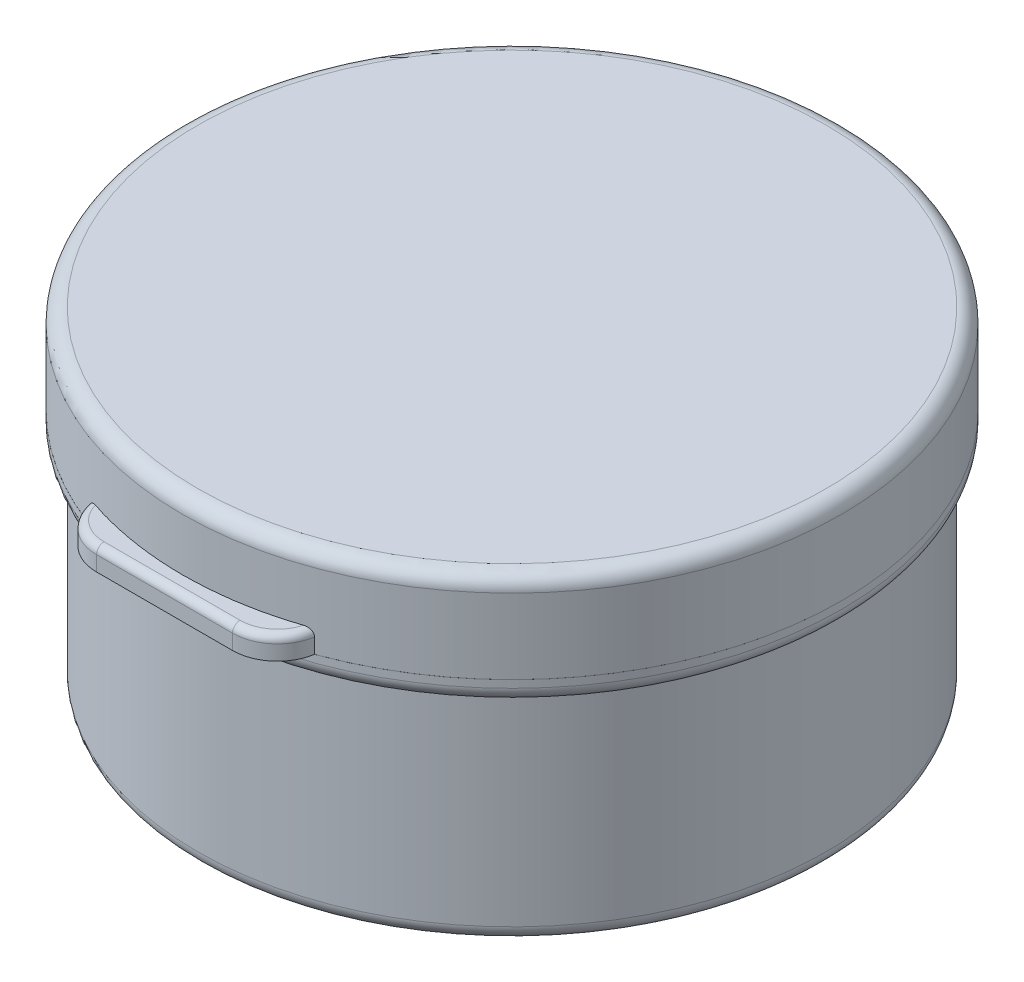
ISO-10303-21;
HEADER;
FILE_DESCRIPTION(('STEP AP214'),'2;1');
FILE_NAME('part.step','',(''),(''),'','','');
FILE_SCHEMA(('AUTOMOTIVE_DESIGN { 1 0 10303 214 1 1 1 1 }'));
ENDSEC;
DATA;
#1=APPLICATION_CONTEXT('core data for automotive mechanical design processes');
#2=APPLICATION_PROTOCOL_DEFINITION('international standard','automotive_design',2000,#1);
#3=PRODUCT_CONTEXT('',#1,'mechanical');
#4=PRODUCT('Part','Part','',(#3));
#5=PRODUCT_RELATED_PRODUCT_CATEGORY('part','',(#4));
#6=PRODUCT_DEFINITION_FORMATION('','',#4);
#7=PRODUCT_DEFINITION_CONTEXT('part definition',#1,'design');
#8=PRODUCT_DEFINITION('design','',#6,#7);
#9=PRODUCT_DEFINITION_SHAPE('','',#8);
#10=(LENGTH_UNIT() NAMED_UNIT(*) SI_UNIT(.MILLI.,.METRE.));
#11=(NAMED_UNIT(*) PLANE_ANGLE_UNIT() SI_UNIT($,.RADIAN.));
#12=(NAMED_UNIT(*) SI_UNIT($,.STERADIAN.) SOLID_ANGLE_UNIT());
#13=UNCERTAINTY_MEASURE_WITH_UNIT(LENGTH_MEASURE(1.E-05),#10,'distance_accuracy_value','');
#14=(GEOMETRIC_REPRESENTATION_CONTEXT(3) GLOBAL_UNCERTAINTY_ASSIGNED_CONTEXT((#13)) GLOBAL_UNIT_ASSIGNED_CONTEXT((#10,
#11,#12)) REPRESENTATION_CONTEXT('',''));
#15=CARTESIAN_POINT('',(0.,0.,0.));
#16=DIRECTION('',(0.,0.,1.));
#17=DIRECTION('',(1.,0.,0.));
#18=AXIS2_PLACEMENT_3D('',#15,#16,#17);
#19=CARTESIAN_POINT('',(0.,21.,0.));
#20=DIRECTION('',(0.,-1.,0.));
#21=DIRECTION('',(0.,0.,-1.));
#22=AXIS2_PLACEMENT_3D('',#19,#20,#21);
#23=CYLINDRICAL_SURFACE('',#22,21.);
#24=CARTESIAN_POINT('',(0.,16.,0.));
#25=DIRECTION('',(0.,1.,0.));
#26=DIRECTION('',(0.,0.,1.));
#27=AXIS2_PLACEMENT_3D('',#24,#25,#26);
#28=CIRCLE('',#27,21.);
#29=CARTESIAN_POINT('',(0.,16.,21.));
#30=VERTEX_POINT('',#29);
#31=EDGE_CURVE('P0_E97',#30,#30,#28,.T.);
#32=ORIENTED_EDGE('',*,*,#31,.T.);
#33=EDGE_LOOP('',(#32));
#34=FACE_BOUND('',#33,.T.);
#35=CARTESIAN_POINT('',(0.,19.5,0.));
#36=DIRECTION('',(0.,1.,0.));
#37=DIRECTION('',(0.,0.,1.));
#38=AXIS2_PLACEMENT_3D('',#35,#36,#37);
#39=CIRCLE('',#38,21.);
#40=CARTESIAN_POINT('',(0.,19.5,21.));
#41=VERTEX_POINT('',#40);
#42=EDGE_CURVE('P0_E341',#41,#41,#39,.T.);
#43=ORIENTED_EDGE('',*,*,#42,.F.);
#44=EDGE_LOOP('',(#43));
#45=FACE_BOUND('',#44,.T.);
#46=ADVANCED_FACE('P0_F19',(#34,#45),#23,.T.);
#47=CARTESIAN_POINT('',(-6.,15.,-21.1660104885167));
#48=DIRECTION('',(-1.,0.,0.));
#49=DIRECTION('',(0.,0.,1.));
#50=AXIS2_PLACEMENT_3D('',#47,#48,#49);
#51=PLANE('',#50);
#52=DIRECTION('',(0.,0.,1.));
#53=VECTOR('',#52,1.);
#54=CARTESIAN_POINT('',(-6.,16.,-21.1660104885167));
#55=LINE('',#54,#53);
#56=CARTESIAN_POINT('',(-6.,16.,-23.));
#57=VERTEX_POINT('',#56);
#58=CARTESIAN_POINT('',(-6.,16.,-21.1660104885167));
#59=VERTEX_POINT('',#58);
#60=EDGE_CURVE('P0_E73',#57,#59,#55,.T.);
#61=ORIENTED_EDGE('',*,*,#60,.F.);
#62=DIRECTION('',(0.,-0.662620048215738,0.748955720789002));
#63=VECTOR('',#62,1.);
#64=CARTESIAN_POINT('',(-6.,14.6507750558159,-21.4749786196495));
#65=LINE('',#64,#63);
#66=CARTESIAN_POINT('',(-6.00000000000001,15.,-21.8697056136383));
#67=VERTEX_POINT('',#66);
#68=EDGE_CURVE('P0_E68',#57,#67,#65,.T.);
#69=ORIENTED_EDGE('',*,*,#68,.T.);
#70=DIRECTION('',(0.,0.,1.));
#71=VECTOR('',#70,1.);
#72=CARTESIAN_POINT('',(-6.,15.,-21.1660104885167));
#73=LINE('',#72,#71);
#74=CARTESIAN_POINT('',(-6.,15.,-21.0267226870701));
#75=VERTEX_POINT('',#74);
#76=EDGE_CURVE('P0_E34',#67,#75,#73,.T.);
#77=ORIENTED_EDGE('',*,*,#76,.T.);
#78=CARTESIAN_POINT('',(-6.,15.,-21.0267226870701));
#79=CARTESIAN_POINT('',(-6.,15.0236927175322,-21.040946709731));
#80=CARTESIAN_POINT('',(-6.,15.047967628017,-21.0541717958448));
#81=CARTESIAN_POINT('',(-6.,15.0975528392953,-21.0785365194592));
#82=CARTESIAN_POINT('',(-6.,15.1228635070889,-21.0896754098236));
#83=CARTESIAN_POINT('',(-6.,15.1989252841215,-21.1193473642655));
#84=CARTESIAN_POINT('',(-6.,15.2509281051254,-21.134807205526));
#85=CARTESIAN_POINT('',(-6.,15.335833680094,-21.1524728369288));
#86=CARTESIAN_POINT('',(-6.,15.3681851254462,-21.1575009958536));
#87=CARTESIAN_POINT('',(-6.,15.4336804313749,-21.1642937668788));
#88=CARTESIAN_POINT('',(-6.,15.4668290656496,-21.1660123634298));
#89=CARTESIAN_POINT('',(-6.,15.5,-21.1660104885167));
#90=B_SPLINE_CURVE_WITH_KNOTS('',3,(#78,#79,#80,#81,#82,#83,#84,#85,#86,#87,#88,#89),
.UNSPECIFIED.,.F.,.F.,(4,2,2,2,2,4),(0.,0.0828485838203804,0.16572678198496,0.327608443244328,
0.425678960276971,0.525103456925898),.UNSPECIFIED.);
#91=CARTESIAN_POINT('',(-6.,15.5,-21.1660104885167));
#92=VERTEX_POINT('',#91);
#93=EDGE_CURVE('P0_E365',#75,#92,#90,.T.);
#94=ORIENTED_EDGE('',*,*,#93,.T.);
#95=DIRECTION('',(0.,1.,0.));
#96=VECTOR('',#95,1.);
#97=CARTESIAN_POINT('',(-6.,15.,-21.1660104885167));
#98=LINE('',#97,#96);
#99=EDGE_CURVE('P0_E95',#92,#59,#98,.T.);
#100=ORIENTED_EDGE('',*,*,#99,.T.);
#101=EDGE_LOOP('',(#61,#69,#77,#94,#100));
#102=FACE_BOUND('',#101,.T.);
#103=ADVANCED_FACE('P0_F144',(#102),#51,.T.);
#104=CARTESIAN_POINT('',(6.,15.,-21.1660104885167));
#105=DIRECTION('',(1.,0.,0.));
#106=DIRECTION('',(0.,0.,-1.));
#107=AXIS2_PLACEMENT_3D('',#104,#105,#106);
#108=PLANE('',#107);
#109=DIRECTION('',(0.,0.,-1.));
#110=VECTOR('',#109,1.);
#111=CARTESIAN_POINT('',(6.,15.,-21.1660104885167));
#112=LINE('',#111,#110);
#113=CARTESIAN_POINT('',(6.,15.,-21.0267226870701));
#114=VERTEX_POINT('',#113);
#115=CARTESIAN_POINT('',(6.,15.,-21.8697056136383));
#116=VERTEX_POINT('',#115);
#117=EDGE_CURVE('P0_E82',#114,#116,#112,.T.);
#118=ORIENTED_EDGE('',*,*,#117,.T.);
#119=DIRECTION('',(0.,0.662620048215738,-0.748955720789002));
#120=VECTOR('',#119,1.);
#121=CARTESIAN_POINT('',(6.,14.6507750558159,-21.4749786196495));
#122=LINE('',#121,#120);
#123=CARTESIAN_POINT('',(6.,16.,-23.));
#124=VERTEX_POINT('',#123);
#125=EDGE_CURVE('P0_E66',#116,#124,#122,.T.);
#126=ORIENTED_EDGE('',*,*,#125,.T.);
#127=DIRECTION('',(0.,0.,-1.));
#128=VECTOR('',#127,1.);
#129=CARTESIAN_POINT('',(6.,16.,-21.1660104885167));
#130=LINE('',#129,#128);
#131=CARTESIAN_POINT('',(6.,16.,-21.1660104885167));
#132=VERTEX_POINT('',#131);
#133=EDGE_CURVE('P0_E74',#132,#124,#130,.T.);
#134=ORIENTED_EDGE('',*,*,#133,.F.);
#135=DIRECTION('',(0.,1.,0.));
#136=VECTOR('',#135,1.);
#137=CARTESIAN_POINT('',(6.,15.,-21.1660104885167));
#138=LINE('',#137,#136);
#139=CARTESIAN_POINT('',(6.,15.5,-21.1660104885167));
#140=VERTEX_POINT('',#139);
#141=EDGE_CURVE('P0_E98',#140,#132,#138,.T.);
#142=ORIENTED_EDGE('',*,*,#141,.F.);
#143=CARTESIAN_POINT('',(6.,15.5,-21.1660104885167));
#144=CARTESIAN_POINT('',(6.,15.4723667902177,-21.1660100153196));
#145=CARTESIAN_POINT('',(6.,15.4447502564293,-21.1648189044923));
#146=CARTESIAN_POINT('',(6.,15.3897169422819,-21.1600695984326));
#147=CARTESIAN_POINT('',(6.,15.362300195263,-21.1565110168693));
#148=CARTESIAN_POINT('',(6.,15.2818766532501,-21.1425257101084));
#149=CARTESIAN_POINT('',(6.,15.2293983573191,-21.1287855308274));
#150=CARTESIAN_POINT('',(6.,15.1476146323437,-21.0999229546898));
#151=CARTESIAN_POINT('',(6.,15.1173245820546,-21.0874774285868));
#152=CARTESIAN_POINT('',(6.,15.0577288789119,-21.0594367859053));
#153=CARTESIAN_POINT('',(6.,15.0284424752718,-21.0438007354684));
#154=CARTESIAN_POINT('',(6.,15.,-21.0267226870701));
#155=B_SPLINE_CURVE_WITH_KNOTS('',3,(#143,#144,#145,#146,#147,#148,#149,#150,#151,#152,#153,
#154),.UNSPECIFIED.,.F.,.F.,(4,2,2,2,2,4),(0.,0.082840944240274,0.165695410028507,
0.327558866446054,0.42565731471964,0.525103916815458),.UNSPECIFIED.);
#156=EDGE_CURVE('P0_E126',#140,#114,#155,.T.);
#157=ORIENTED_EDGE('',*,*,#156,.T.);
#158=EDGE_LOOP('',(#118,#126,#134,#142,#157));
#159=FACE_BOUND('',#158,.T.);
#160=ADVANCED_FACE('P0_F78',(#159),#108,.T.);
#161=CARTESIAN_POINT('',(0.,15.,4.16333634234434E-13));
#162=DIRECTION('',(0.,1.,0.));
#163=DIRECTION('',(0.,0.,1.));
#164=AXIS2_PLACEMENT_3D('',#161,#162,#163);
#165=PLANE('',#164);
#166=DIRECTION('',(-1.,0.,0.));
#167=VECTOR('',#166,1.);
#168=CARTESIAN_POINT('',(0.,15.,-21.8697056136383));
#169=LINE('',#168,#167);
#170=EDGE_CURVE('P0_E109',#116,#67,#169,.T.);
#171=ORIENTED_EDGE('',*,*,#170,.F.);
#172=ORIENTED_EDGE('',*,*,#117,.F.);
#173=CARTESIAN_POINT('',(0.,15.,0.));
#174=DIRECTION('',(0.,1.,0.));
#175=DIRECTION('',(0.,0.,1.));
#176=AXIS2_PLACEMENT_3D('',#173,#174,#175);
#177=CIRCLE('',#176,21.8660254037844);
#178=EDGE_CURVE('P0_E134',#114,#75,#177,.T.);
#179=ORIENTED_EDGE('',*,*,#178,.T.);
#180=ORIENTED_EDGE('',*,*,#76,.F.);
#181=EDGE_LOOP('',(#171,#172,#179,#180));
#182=FACE_BOUND('',#181,.T.);
#183=ADVANCED_FACE('P0_F143',(#182),#165,.F.);
#184=CARTESIAN_POINT('',(0.,16.,0.));
#185=DIRECTION('',(0.,1.,0.));
#186=DIRECTION('',(0.,0.,1.));
#187=AXIS2_PLACEMENT_3D('',#184,#185,#186);
#188=PLANE('',#187);
#189=CARTESIAN_POINT('',(0.,16.,0.));
#190=DIRECTION('',(0.,1.,0.));
#191=DIRECTION('',(0.,0.,1.));
#192=AXIS2_PLACEMENT_3D('',#189,#190,#191);
#193=CIRCLE('',#192,22.);
#194=EDGE_CURVE('P0_E88',#59,#132,#193,.T.);
#195=ORIENTED_EDGE('',*,*,#194,.T.);
#196=ORIENTED_EDGE('',*,*,#133,.T.);
#197=DIRECTION('',(-1.,0.,0.));
#198=VECTOR('',#197,1.);
#199=CARTESIAN_POINT('',(6.,16.,-23.));
#200=LINE('',#199,#198);
#201=EDGE_CURVE('P0_E63',#124,#57,#200,.T.);
#202=ORIENTED_EDGE('',*,*,#201,.T.);
#203=ORIENTED_EDGE('',*,*,#60,.T.);
#204=EDGE_LOOP('',(#195,#196,#202,#203));
#205=FACE_BOUND('',#204,.T.);
#206=ORIENTED_EDGE('',*,*,#31,.F.);
#207=EDGE_LOOP('',(#206));
#208=FACE_BOUND('',#207,.T.);
#209=ADVANCED_FACE('P0_F85',(#205,#208),#188,.T.);
#210=CARTESIAN_POINT('',(0.,16.,0.));
#211=DIRECTION('',(0.,-1.,0.));
#212=DIRECTION('',(0.,0.,-1.));
#213=AXIS2_PLACEMENT_3D('',#210,#211,#212);
#214=CYLINDRICAL_SURFACE('',#213,22.);
#215=ORIENTED_EDGE('',*,*,#99,.F.);
#216=CARTESIAN_POINT('',(0.,15.5,0.));
#217=DIRECTION('',(0.,1.,0.));
#218=DIRECTION('',(0.,0.,1.));
#219=AXIS2_PLACEMENT_3D('',#216,#217,#218);
#220=CIRCLE('',#219,22.);
#221=EDGE_CURVE('P0_E117',#92,#140,#220,.T.);
#222=ORIENTED_EDGE('',*,*,#221,.T.);
#223=ORIENTED_EDGE('',*,*,#141,.T.);
#224=ORIENTED_EDGE('',*,*,#194,.F.);
#225=EDGE_LOOP('',(#215,#222,#223,#224));
#226=FACE_BOUND('',#225,.T.);
#227=ADVANCED_FACE('P0_F149',(#226),#214,.T.);
#228=CARTESIAN_POINT('',(0.,0.,0.));
#229=DIRECTION('',(0.,1.,0.));
#230=DIRECTION('',(0.,0.,1.));
#231=AXIS2_PLACEMENT_3D('',#228,#229,#230);
#232=PLANE('',#231);
#233=CARTESIAN_POINT('',(0.,0.,0.));
#234=DIRECTION('',(0.,-1.,0.));
#235=DIRECTION('',(0.,0.,-1.));
#236=AXIS2_PLACEMENT_3D('',#233,#234,#235);
#237=CIRCLE('',#236,18.);
#238=CARTESIAN_POINT('',(0.,0.,-18.));
#239=VERTEX_POINT('',#238);
#240=EDGE_CURVE('P0_E348',#239,#239,#237,.T.);
#241=ORIENTED_EDGE('',*,*,#240,.F.);
#242=EDGE_LOOP('',(#241));
#243=FACE_BOUND('',#242,.T.);
#244=CARTESIAN_POINT('',(0.,0.,0.));
#245=DIRECTION('',(0.,1.,0.));
#246=DIRECTION('',(0.,0.,1.));
#247=AXIS2_PLACEMENT_3D('',#244,#245,#246);
#248=CIRCLE('',#247,20.);
#249=CARTESIAN_POINT('',(0.,0.,20.));
#250=VERTEX_POINT('',#249);
#251=EDGE_CURVE('P0_E123',#250,#250,#248,.F.);
#252=ORIENTED_EDGE('',*,*,#251,.T.);
#253=EDGE_LOOP('',(#252));
#254=FACE_BOUND('',#253,.T.);
#255=ADVANCED_FACE('P0_F152',(#243,#254),#232,.F.);
#256=CARTESIAN_POINT('',(0.,1.,0.));
#257=DIRECTION('',(0.,1.,0.));
#258=DIRECTION('',(0.,0.,1.));
#259=AXIS2_PLACEMENT_3D('',#256,#257,#258);
#260=CIRCLE('',#259,21.);
#261=CARTESIAN_POINT('',(0.,1.,21.));
#262=VERTEX_POINT('',#261);
#263=EDGE_CURVE('P0_E120',#262,#262,#260,.T.);
#264=ORIENTED_EDGE('',*,*,#263,.T.);
#265=EDGE_LOOP('',(#264));
#266=FACE_BOUND('',#265,.T.);
#267=CARTESIAN_POINT('',(0.,14.5,0.));
#268=DIRECTION('',(0.,1.,0.));
#269=DIRECTION('',(0.,0.,1.));
#270=AXIS2_PLACEMENT_3D('',#267,#268,#269);
#271=CIRCLE('',#270,21.);
#272=CARTESIAN_POINT('',(0.,14.5,21.));
#273=VERTEX_POINT('',#272);
#274=EDGE_CURVE('P0_E106',#273,#273,#271,.T.);
#275=ORIENTED_EDGE('',*,*,#274,.F.);
#276=EDGE_LOOP('',(#275));
#277=FACE_BOUND('',#276,.T.);
#278=ADVANCED_FACE('P0_F170',(#266,#277),#23,.T.);
#279=CARTESIAN_POINT('',(22.,-2.43932599663404,-2.15813333771025));
#280=DIRECTION('',(0.,-0.748955720789002,-0.662620048215738));
#281=DIRECTION('',(0.,0.662620048215738,-0.748955720789002));
#282=AXIS2_PLACEMENT_3D('',#279,#280,#281);
#283=PLANE('',#282);
#284=ORIENTED_EDGE('',*,*,#201,.F.);
#285=ORIENTED_EDGE('',*,*,#125,.F.);
#286=ORIENTED_EDGE('',*,*,#170,.T.);
#287=ORIENTED_EDGE('',*,*,#68,.F.);
#288=EDGE_LOOP('',(#284,#285,#286,#287));
#289=FACE_BOUND('',#288,.T.);
#290=ADVANCED_FACE('P0_F65',(#289),#283,.T.);
#291=CARTESIAN_POINT('',(0.,15.5,0.));
#292=DIRECTION('',(0.,1.,0.));
#293=DIRECTION('',(0.,0.,1.));
#294=AXIS2_PLACEMENT_3D('',#291,#292,#293);
#295=TOROIDAL_SURFACE('',#294,21.,1.);
#296=ORIENTED_EDGE('',*,*,#274,.T.);
#297=EDGE_LOOP('',(#296));
#298=FACE_BOUND('',#297,.T.);
#299=ORIENTED_EDGE('',*,*,#156,.F.);
#300=ORIENTED_EDGE('',*,*,#221,.F.);
#301=ORIENTED_EDGE('',*,*,#93,.F.);
#302=ORIENTED_EDGE('',*,*,#178,.F.);
#303=EDGE_LOOP('',(#299,#300,#301,#302));
#304=FACE_BOUND('',#303,.T.);
#305=ADVANCED_FACE('P0_F136',(#298,#304),#295,.T.);
#306=CARTESIAN_POINT('',(0.,1.,0.));
#307=DIRECTION('',(0.,1.,0.));
#308=DIRECTION('',(0.,0.,1.));
#309=AXIS2_PLACEMENT_3D('',#306,#307,#308);
#310=TOROIDAL_SURFACE('',#309,20.,1.);
#311=ORIENTED_EDGE('',*,*,#251,.F.);
#312=EDGE_LOOP('',(#311));
#313=FACE_BOUND('',#312,.T.);
#314=ORIENTED_EDGE('',*,*,#263,.F.);
#315=EDGE_LOOP('',(#314));
#316=FACE_BOUND('',#315,.T.);
#317=ADVANCED_FACE('P0_F295',(#313,#316),#310,.T.);
#318=CARTESIAN_POINT('',(0.,19.5,0.));
#319=DIRECTION('',(0.,1.,0.));
#320=DIRECTION('',(0.,0.,1.));
#321=AXIS2_PLACEMENT_3D('',#318,#319,#320);
#322=CYLINDRICAL_SURFACE('',#321,21.01);
#323=CARTESIAN_POINT('',(0.,20.5,0.));
#324=DIRECTION('',(0.,1.,0.));
#325=DIRECTION('',(0.,0.,1.));
#326=AXIS2_PLACEMENT_3D('',#323,#324,#325);
#327=CIRCLE('',#326,21.01);
#328=CARTESIAN_POINT('',(0.,20.5,21.01));
#329=VERTEX_POINT('',#328);
#330=EDGE_CURVE('P0_E12',#329,#329,#327,.F.);
#331=ORIENTED_EDGE('',*,*,#330,.T.);
#332=EDGE_LOOP('',(#331));
#333=FACE_BOUND('',#332,.T.);
#334=CARTESIAN_POINT('',(0.,19.5,0.));
#335=DIRECTION('',(0.,1.,0.));
#336=DIRECTION('',(0.,0.,1.));
#337=AXIS2_PLACEMENT_3D('',#334,#335,#336);
#338=CIRCLE('',#337,21.01);
#339=CARTESIAN_POINT('',(0.,19.5,21.01));
#340=VERTEX_POINT('',#339);
#341=EDGE_CURVE('P0_E83',#340,#340,#338,.T.);
#342=ORIENTED_EDGE('',*,*,#341,.T.);
#343=EDGE_LOOP('',(#342));
#344=FACE_BOUND('',#343,.T.);
#345=ADVANCED_FACE('P0_F303',(#333,#344),#322,.T.);
#346=CARTESIAN_POINT('',(0.,19.5,0.));
#347=DIRECTION('',(0.,1.,0.));
#348=DIRECTION('',(0.,0.,1.));
#349=AXIS2_PLACEMENT_3D('',#346,#347,#348);
#350=PLANE('',#349);
#351=ORIENTED_EDGE('',*,*,#42,.T.);
#352=EDGE_LOOP('',(#351));
#353=FACE_BOUND('',#352,.T.);
#354=ORIENTED_EDGE('',*,*,#341,.F.);
#355=EDGE_LOOP('',(#354));
#356=FACE_BOUND('',#355,.T.);
#357=ADVANCED_FACE('P0_F163',(#353,#356),#350,.F.);
#358=CARTESIAN_POINT('',(0.,1.,0.));
#359=DIRECTION('',(0.,1.,0.));
#360=DIRECTION('',(0.,0.,1.));
#361=AXIS2_PLACEMENT_3D('',#358,#359,#360);
#362=PLANE('',#361);
#363=CARTESIAN_POINT('',(0.,1.,0.));
#364=DIRECTION('',(0.,1.,0.));
#365=DIRECTION('',(0.,0.,1.));
#366=AXIS2_PLACEMENT_3D('',#363,#364,#365);
#367=CIRCLE('',#366,19.5);
#368=CARTESIAN_POINT('',(0.,1.,19.5));
#369=VERTEX_POINT('',#368);
#370=EDGE_CURVE('P0_E111',#369,#369,#367,.T.);
#371=ORIENTED_EDGE('',*,*,#370,.T.);
#372=EDGE_LOOP('',(#371));
#373=FACE_BOUND('',#372,.T.);
#374=ADVANCED_FACE('P0_F160',(#373),#362,.T.);
#375=CARTESIAN_POINT('',(0.,1.5,0.));
#376=DIRECTION('',(0.,1.,0.));
#377=DIRECTION('',(0.,0.,1.));
#378=AXIS2_PLACEMENT_3D('',#375,#376,#377);
#379=TOROIDAL_SURFACE('',#378,19.5,0.5);
#380=CARTESIAN_POINT('',(0.,1.5,0.));
#381=DIRECTION('',(0.,1.,0.));
#382=DIRECTION('',(0.,0.,1.));
#383=AXIS2_PLACEMENT_3D('',#380,#381,#382);
#384=CIRCLE('',#383,20.);
#385=CARTESIAN_POINT('',(0.,1.5,20.));
#386=VERTEX_POINT('',#385);
#387=EDGE_CURVE('P0_E114',#386,#386,#384,.F.);
#388=ORIENTED_EDGE('',*,*,#387,.F.);
#389=EDGE_LOOP('',(#388));
#390=FACE_BOUND('',#389,.T.);
#391=ORIENTED_EDGE('',*,*,#370,.F.);
#392=EDGE_LOOP('',(#391));
#393=FACE_BOUND('',#392,.T.);
#394=ADVANCED_FACE('P0_F158',(#390,#393),#379,.F.);
#395=CARTESIAN_POINT('',(0.,21.,0.));
#396=DIRECTION('',(0.,-1.,0.));
#397=DIRECTION('',(0.,0.,-1.));
#398=AXIS2_PLACEMENT_3D('',#395,#396,#397);
#399=CYLINDRICAL_SURFACE('',#398,20.);
#400=ORIENTED_EDGE('',*,*,#387,.T.);
#401=EDGE_LOOP('',(#400));
#402=FACE_BOUND('',#401,.T.);
#403=CARTESIAN_POINT('',(0.,21.,0.));
#404=DIRECTION('',(0.,1.,0.));
#405=DIRECTION('',(0.,0.,1.));
#406=AXIS2_PLACEMENT_3D('',#403,#404,#405);
#407=CIRCLE('',#406,20.);
#408=CARTESIAN_POINT('',(0.,21.,20.));
#409=VERTEX_POINT('',#408);
#410=EDGE_CURVE('P0_E103',#409,#409,#407,.T.);
#411=ORIENTED_EDGE('',*,*,#410,.T.);
#412=EDGE_LOOP('',(#411));
#413=FACE_BOUND('',#412,.T.);
#414=ADVANCED_FACE('P0_F154',(#402,#413),#399,.F.);
#415=CARTESIAN_POINT('',(0.,21.,0.));
#416=DIRECTION('',(0.,1.,0.));
#417=DIRECTION('',(0.,0.,1.));
#418=AXIS2_PLACEMENT_3D('',#415,#416,#417);
#419=PLANE('',#418);
#420=CARTESIAN_POINT('',(0.,21.,0.));
#421=DIRECTION('',(0.,1.,0.));
#422=DIRECTION('',(0.,0.,1.));
#423=AXIS2_PLACEMENT_3D('',#420,#421,#422);
#424=CIRCLE('',#423,20.51);
#425=CARTESIAN_POINT('',(0.,21.,20.51));
#426=VERTEX_POINT('',#425);
#427=EDGE_CURVE('P0_E28',#426,#426,#424,.T.);
#428=ORIENTED_EDGE('',*,*,#427,.T.);
#429=EDGE_LOOP('',(#428));
#430=FACE_BOUND('',#429,.T.);
#431=ORIENTED_EDGE('',*,*,#410,.F.);
#432=EDGE_LOOP('',(#431));
#433=FACE_BOUND('',#432,.T.);
#434=ADVANCED_FACE('P0_F157',(#430,#433),#419,.T.);
#435=CARTESIAN_POINT('',(0.,20.5,0.));
#436=DIRECTION('',(0.,1.,0.));
#437=DIRECTION('',(0.,0.,1.));
#438=AXIS2_PLACEMENT_3D('',#435,#436,#437);
#439=TOROIDAL_SURFACE('',#438,20.51,0.5);
#440=ORIENTED_EDGE('',*,*,#330,.F.);
#441=EDGE_LOOP('',(#440));
#442=FACE_BOUND('',#441,.T.);
#443=ORIENTED_EDGE('',*,*,#427,.F.);
#444=EDGE_LOOP('',(#443));
#445=FACE_BOUND('',#444,.T.);
#446=ADVANCED_FACE('P0_F21',(#442,#445),#439,.T.);
#447=CARTESIAN_POINT('',(0.,0.1,0.));
#448=DIRECTION('',(0.,-1.,0.));
#449=DIRECTION('',(0.,0.,-1.));
#450=AXIS2_PLACEMENT_3D('',#447,#448,#449);
#451=CYLINDRICAL_SURFACE('',#450,18.);
#452=CARTESIAN_POINT('',(0.,0.1,0.));
#453=DIRECTION('',(0.,-1.,0.));
#454=DIRECTION('',(0.,0.,-1.));
#455=AXIS2_PLACEMENT_3D('',#452,#453,#454);
#456=CIRCLE('',#455,18.);
#457=CARTESIAN_POINT('',(0.,0.1,-18.));
#458=VERTEX_POINT('',#457);
#459=EDGE_CURVE('P0_E345',#458,#458,#456,.T.);
#460=ORIENTED_EDGE('',*,*,#459,.F.);
#461=EDGE_LOOP('',(#460));
#462=FACE_BOUND('',#461,.T.);
#463=ORIENTED_EDGE('',*,*,#240,.T.);
#464=EDGE_LOOP('',(#463));
#465=FACE_BOUND('',#464,.T.);
#466=ADVANCED_FACE('P0_F207',(#462,#465),#451,.F.);
#467=CARTESIAN_POINT('',(0.,0.1,0.));
#468=DIRECTION('',(0.,-1.,0.));
#469=DIRECTION('',(0.,0.,-1.));
#470=AXIS2_PLACEMENT_3D('',#467,#468,#469);
#471=PLANE('',#470);
#472=ORIENTED_EDGE('',*,*,#459,.T.);
#473=EDGE_LOOP('',(#472));
#474=FACE_BOUND('',#473,.T.);
#475=ADVANCED_FACE('P0_F215',(#474),#471,.T.);
#476=CLOSED_SHELL('',(#46,#103,#160,#183,#209,#227,#255,#278,#290,#305,#317,#345,#357,#374,#394,
#414,#434,#446,#466,#475));
#477=MANIFOLD_SOLID_BREP('P0_B1',#476);
#478=CARTESIAN_POINT('',(0.,17.5,-0.00398951148319938));
#479=DIRECTION('',(0.,-1.,0.));
#480=DIRECTION('',(0.,0.,-1.));
#481=AXIS2_PLACEMENT_3D('',#478,#479,#480);
#482=CYLINDRICAL_SURFACE('',#481,22.);
#483=CARTESIAN_POINT('',(0.,17.5,-0.00398951148319938));
#484=DIRECTION('',(0.,1.,0.));
#485=DIRECTION('',(0.,0.,1.));
#486=AXIS2_PLACEMENT_3D('',#483,#484,#485);
#487=CIRCLE('',#486,22.);
#488=CARTESIAN_POINT('',(-6.94625148854036,17.5,20.8706264193059));
#489=VERTEX_POINT('',#488);
#490=CARTESIAN_POINT('',(6.94625148854028,17.5,20.8706264193059));
#491=VERTEX_POINT('',#490);
#492=EDGE_CURVE('P1_E80',#489,#491,#487,.T.);
#493=ORIENTED_EDGE('',*,*,#492,.T.);
#494=CARTESIAN_POINT('',(6.94625148854028,17.5,20.8706264193059));
#495=CARTESIAN_POINT('',(6.98653368834904,17.5000277279296,20.8572293957804));
#496=CARTESIAN_POINT('',(7.02690438244175,17.4962866960226,20.8436590308074));
#497=CARTESIAN_POINT('',(7.10637206870246,17.4809891631222,20.8167011994502));
#498=CARTESIAN_POINT('',(7.1454631910606,17.4694008320486,20.8033147053877));
#499=CARTESIAN_POINT('',(7.21141543127778,17.4419368040245,20.7805338052653));
#500=CARTESIAN_POINT('',(7.23893554242528,17.4277939458699,20.7709614911075));
#501=CARTESIAN_POINT('',(7.29133193858208,17.3949121580745,20.7526297301761));
#502=CARTESIAN_POINT('',(7.3162132557337,17.376182210313,20.7438687404193));
#503=CARTESIAN_POINT('',(7.36259330509713,17.3341506211638,20.7274559676968));
#504=CARTESIAN_POINT('',(7.38406575093242,17.3108162977325,20.7198128371888));
#505=CARTESIAN_POINT('',(7.42234208615401,17.2601390810016,20.7061349023964));
#506=CARTESIAN_POINT('',(7.43914616932169,17.2327963541608,20.7001000313543));
#507=CARTESIAN_POINT('',(7.46526793840534,17.1787143037214,20.6906944009265));
#508=CARTESIAN_POINT('',(7.47526897346078,17.1523465490223,20.6870813670527));
#509=CARTESIAN_POINT('',(7.49038387778858,17.0981214946722,20.6816146182844));
#510=CARTESIAN_POINT('',(7.49551111313815,17.0702684913539,20.6797560918648));
#511=CARTESIAN_POINT('',(7.49936368986106,17.0281558913954,20.6783590093801));
#512=CARTESIAN_POINT('',(7.50000913593238,17.0140737042994,20.6781247498406));
#513=CARTESIAN_POINT('',(7.49999999999996,17.,20.6781283684633));
#514=B_SPLINE_CURVE_WITH_KNOTS('',3,(#494,#495,#496,#497,#498,#499,#500,#501,#502,#503,#504,
#505,#506,#507,#508,#509,#510,#511,#512,#513),.UNSPECIFIED.,.F.,.F.,(4,2,2,2,2,2,2,2,2,4),(0.,
0.127420250542173,0.255360461489474,0.352124471656088,0.448700504311982,0.54598843754486,
0.643272331801367,0.728091403363767,0.812677187300663,0.854905742782581),.UNSPECIFIED.);
#515=CARTESIAN_POINT('',(7.49999999999996,17.,20.6781283684633));
#516=VERTEX_POINT('',#515);
#517=EDGE_CURVE('P1_E78',#491,#516,#514,.T.);
#518=ORIENTED_EDGE('',*,*,#517,.T.);
#519=DIRECTION('',(0.,-1.,0.));
#520=VECTOR('',#519,1.);
#521=CARTESIAN_POINT('',(7.49999999999996,17.5,20.6781283684633));
#522=LINE('',#521,#520);
#523=CARTESIAN_POINT('',(7.49999999999996,16.,20.6781283684633));
#524=VERTEX_POINT('',#523);
#525=EDGE_CURVE('P1_E72',#516,#524,#522,.T.);
#526=ORIENTED_EDGE('',*,*,#525,.T.);
#527=CARTESIAN_POINT('',(0.,16.,-0.00398951148319938));
#528=DIRECTION('',(0.,1.,0.));
#529=DIRECTION('',(0.,0.,1.));
#530=AXIS2_PLACEMENT_3D('',#527,#528,#529);
#531=CIRCLE('',#530,22.);
#532=CARTESIAN_POINT('',(-7.50000000000004,16.,20.6781283684633));
#533=VERTEX_POINT('',#532);
#534=EDGE_CURVE('P1_E77',#533,#524,#531,.T.);
#535=ORIENTED_EDGE('',*,*,#534,.F.);
#536=DIRECTION('',(0.,-1.,0.));
#537=VECTOR('',#536,1.);
#538=CARTESIAN_POINT('',(-7.50000000000004,17.5,20.6781283684633));
#539=LINE('',#538,#537);
#540=CARTESIAN_POINT('',(-7.50000000000004,17.,20.6781283684633));
#541=VERTEX_POINT('',#540);
#542=EDGE_CURVE('P1_E79',#541,#533,#539,.T.);
#543=ORIENTED_EDGE('',*,*,#542,.F.);
#544=CARTESIAN_POINT('',(-7.50000000000004,17.,20.6781283684633));
#545=CARTESIAN_POINT('',(-7.50003327123003,17.025484877441,20.6781149408796));
#546=CARTESIAN_POINT('',(-7.49790450139765,17.0509446874845,20.6788882627641));
#547=CARTESIAN_POINT('',(-7.48958923131274,17.1010049179086,20.681901507859));
#548=CARTESIAN_POINT('',(-7.48341861271553,17.1256083065776,20.684135690841));
#549=CARTESIAN_POINT('',(-7.46728744685703,17.1733413588734,20.6899633916549));
#550=CARTESIAN_POINT('',(-7.45732932034591,17.1964719528225,20.693556041227));
#551=CARTESIAN_POINT('',(-7.43404364027384,17.2407432754897,20.7019311116107));
#552=CARTESIAN_POINT('',(-7.42071364834461,17.2618825489344,20.7067143933891));
#553=CARTESIAN_POINT('',(-7.39051368223008,17.3026397335958,20.7175107893316));
#554=CARTESIAN_POINT('',(-7.37351253409437,17.3221480231985,20.7235691731068));
#555=CARTESIAN_POINT('',(-7.33694805929498,17.3582409768097,20.7365401265217));
#556=CARTESIAN_POINT('',(-7.31738454575001,17.3748254273663,20.7434527584624));
#557=CARTESIAN_POINT('',(-7.2738064373369,17.4067029252476,20.7587736134156));
#558=CARTESIAN_POINT('',(-7.24953906628585,17.4216111749976,20.7672620252855));
#559=CARTESIAN_POINT('',(-7.19915598983844,17.4475338313553,20.7847783356123));
#560=CARTESIAN_POINT('',(-7.17303737961854,17.4585419482481,20.7938070782987));
#561=CARTESIAN_POINT('',(-7.11407018609199,17.4785462760069,20.8140592872688));
#562=CARTESIAN_POINT('',(-7.0809456541303,17.4866575616692,20.8253509450339));
#563=CARTESIAN_POINT('',(-7.01395259654042,17.4973808111964,20.8480068996103));
#564=CARTESIAN_POINT('',(-6.98008673256226,17.5000099567497,20.8593708571674));
#565=CARTESIAN_POINT('',(-6.94625148854036,17.5,20.8706264193059));
#566=B_SPLINE_CURVE_WITH_KNOTS('',3,(#544,#545,#546,#547,#548,#549,#550,#551,#552,#553,#554,
#555,#556,#557,#558,#559,#560,#561,#562,#563,#564,#565),.UNSPECIFIED.,.F.,.F.,(4,2,2,2,2,2,2,2,
2,2,4),(0.,0.076314934775618,0.152331789372054,0.228300139931601,0.304323584933473,
0.383731412448045,0.463145034650812,0.551952176899355,0.640901892747761,0.748220480865081,
0.855202210899395),.UNSPECIFIED.);
#567=EDGE_CURVE('P1_E112',#541,#489,#566,.T.);
#568=ORIENTED_EDGE('',*,*,#567,.T.);
#569=EDGE_LOOP('',(#493,#518,#526,#535,#543,#568));
#570=FACE_BOUND('',#569,.T.);
#571=ADVANCED_FACE('P1_F17',(#570),#482,.F.);
#572=CARTESIAN_POINT('',(-7.50000000000004,17.5,23.1960104885168));
#573=DIRECTION('',(0.,0.,1.));
#574=DIRECTION('',(1.,0.,0.));
#575=AXIS2_PLACEMENT_3D('',#572,#573,#574);
#576=PLANE('',#575);
#577=DIRECTION('',(0.,1.,0.));
#578=VECTOR('',#577,1.);
#579=CARTESIAN_POINT('',(4.53899301759752,17.5,23.1960104885168));
#580=LINE('',#579,#578);
#581=CARTESIAN_POINT('',(4.53899301759752,16.,23.1960104885168));
#582=VERTEX_POINT('',#581);
#583=CARTESIAN_POINT('',(4.53899301759752,17.,23.1960104885168));
#584=VERTEX_POINT('',#583);
#585=EDGE_CURVE('P1_E84',#582,#584,#580,.T.);
#586=ORIENTED_EDGE('',*,*,#585,.T.);
#587=DIRECTION('',(-1.,0.,0.));
#588=VECTOR('',#587,1.);
#589=CARTESIAN_POINT('',(-7.50000000000004,17.,23.1960104885168));
#590=LINE('',#589,#588);
#591=CARTESIAN_POINT('',(-4.53899301759761,17.,23.1960104885168));
#592=VERTEX_POINT('',#591);
#593=EDGE_CURVE('P1_E11',#584,#592,#590,.T.);
#594=ORIENTED_EDGE('',*,*,#593,.T.);
#595=DIRECTION('',(0.,1.,0.));
#596=VECTOR('',#595,1.);
#597=CARTESIAN_POINT('',(-4.53899301759761,16.,23.1960104885168));
#598=LINE('',#597,#596);
#599=CARTESIAN_POINT('',(-4.53899301759761,16.,23.1960104885168));
#600=VERTEX_POINT('',#599);
#601=EDGE_CURVE('P1_E88',#592,#600,#598,.F.);
#602=ORIENTED_EDGE('',*,*,#601,.T.);
#603=DIRECTION('',(-1.,0.,0.));
#604=VECTOR('',#603,1.);
#605=CARTESIAN_POINT('',(-7.50000000000004,16.,23.1960104885168));
#606=LINE('',#605,#604);
#607=EDGE_CURVE('P1_E94',#582,#600,#606,.T.);
#608=ORIENTED_EDGE('',*,*,#607,.F.);
#609=EDGE_LOOP('',(#586,#594,#602,#608));
#610=FACE_BOUND('',#609,.T.);
#611=ADVANCED_FACE('P1_F129',(#610),#576,.T.);
#612=CARTESIAN_POINT('',(0.,17.5,-0.00398951148319938));
#613=DIRECTION('',(0.,1.,0.));
#614=DIRECTION('',(0.,0.,1.));
#615=AXIS2_PLACEMENT_3D('',#612,#613,#614);
#616=PLANE('',#615);
#617=DIRECTION('',(-1.,0.,0.));
#618=VECTOR('',#617,1.);
#619=CARTESIAN_POINT('',(0.,17.5,22.6960104885168));
#620=LINE('',#619,#618);
#621=CARTESIAN_POINT('',(-4.53899301759761,17.5,22.6960104885168));
#622=VERTEX_POINT('',#621);
#623=CARTESIAN_POINT('',(4.53899301759752,17.5,22.6960104885168));
#624=VERTEX_POINT('',#623);
#625=EDGE_CURVE('P1_E105',#622,#624,#620,.F.);
#626=ORIENTED_EDGE('',*,*,#625,.T.);
#627=CARTESIAN_POINT('',(4.53899301759752,17.5,20.1960104885168));
#628=DIRECTION('',(0.,1.,0.));
#629=DIRECTION('',(0.,0.,1.));
#630=AXIS2_PLACEMENT_3D('',#627,#628,#629);
#631=CIRCLE('',#630,2.5);
#632=EDGE_CURVE('P1_E109',#624,#491,#631,.T.);
#633=ORIENTED_EDGE('',*,*,#632,.T.);
#634=ORIENTED_EDGE('',*,*,#492,.F.);
#635=CARTESIAN_POINT('',(-4.53899301759761,17.5,20.1960104885168));
#636=DIRECTION('',(0.,1.,0.));
#637=DIRECTION('',(0.,0.,1.));
#638=AXIS2_PLACEMENT_3D('',#635,#636,#637);
#639=CIRCLE('',#638,2.5);
#640=EDGE_CURVE('P1_E107',#489,#622,#639,.T.);
#641=ORIENTED_EDGE('',*,*,#640,.T.);
#642=EDGE_LOOP('',(#626,#633,#634,#641));
#643=FACE_BOUND('',#642,.T.);
#644=ADVANCED_FACE('P1_F160',(#643),#616,.T.);
#645=CARTESIAN_POINT('',(0.,16.,-0.00398951148319938));
#646=DIRECTION('',(0.,1.,0.));
#647=DIRECTION('',(0.,0.,1.));
#648=AXIS2_PLACEMENT_3D('',#645,#646,#647);
#649=PLANE('',#648);
#650=ORIENTED_EDGE('',*,*,#534,.T.);
#651=CARTESIAN_POINT('',(4.53899301759752,16.,20.1960104885168));
#652=DIRECTION('',(0.,1.,0.));
#653=DIRECTION('',(0.,0.,1.));
#654=AXIS2_PLACEMENT_3D('',#651,#652,#653);
#655=CIRCLE('',#654,3.);
#656=EDGE_CURVE('P1_E82',#524,#582,#655,.F.);
#657=ORIENTED_EDGE('',*,*,#656,.T.);
#658=ORIENTED_EDGE('',*,*,#607,.T.);
#659=CARTESIAN_POINT('',(-4.53899301759761,16.,20.1960104885168));
#660=DIRECTION('',(0.,1.,0.));
#661=DIRECTION('',(0.,0.,1.));
#662=AXIS2_PLACEMENT_3D('',#659,#660,#661);
#663=CIRCLE('',#662,3.);
#664=EDGE_CURVE('P1_E89',#600,#533,#663,.F.);
#665=ORIENTED_EDGE('',*,*,#664,.T.);
#666=EDGE_LOOP('',(#650,#657,#658,#665));
#667=FACE_BOUND('',#666,.T.);
#668=ADVANCED_FACE('P1_F92',(#667),#649,.F.);
#669=CARTESIAN_POINT('',(4.53899301759752,17.5,20.1960104885168));
#670=DIRECTION('',(0.,-1.,0.));
#671=DIRECTION('',(0.,0.,-1.));
#672=AXIS2_PLACEMENT_3D('',#669,#670,#671);
#673=CYLINDRICAL_SURFACE('',#672,3.);
#674=ORIENTED_EDGE('',*,*,#525,.F.);
#675=CARTESIAN_POINT('',(4.53899301759752,17.,20.1960104885168));
#676=DIRECTION('',(0.,1.,0.));
#677=DIRECTION('',(0.,0.,1.));
#678=AXIS2_PLACEMENT_3D('',#675,#676,#677);
#679=CIRCLE('',#678,3.);
#680=EDGE_CURVE('P1_E41',#516,#584,#679,.F.);
#681=ORIENTED_EDGE('',*,*,#680,.T.);
#682=ORIENTED_EDGE('',*,*,#585,.F.);
#683=ORIENTED_EDGE('',*,*,#656,.F.);
#684=EDGE_LOOP('',(#674,#681,#682,#683));
#685=FACE_BOUND('',#684,.T.);
#686=ADVANCED_FACE('P1_F83',(#685),#673,.T.);
#687=CARTESIAN_POINT('',(-4.53899301759761,17.5,20.1960104885168));
#688=DIRECTION('',(0.,-1.,0.));
#689=DIRECTION('',(0.,0.,-1.));
#690=AXIS2_PLACEMENT_3D('',#687,#688,#689);
#691=CYLINDRICAL_SURFACE('',#690,3.);
#692=ORIENTED_EDGE('',*,*,#601,.F.);
#693=CARTESIAN_POINT('',(-4.53899301759761,17.,20.1960104885168));
#694=DIRECTION('',(0.,1.,0.));
#695=DIRECTION('',(0.,0.,1.));
#696=AXIS2_PLACEMENT_3D('',#693,#694,#695);
#697=CIRCLE('',#696,3.);
#698=EDGE_CURVE('P1_E27',#592,#541,#697,.F.);
#699=ORIENTED_EDGE('',*,*,#698,.T.);
#700=ORIENTED_EDGE('',*,*,#542,.T.);
#701=ORIENTED_EDGE('',*,*,#664,.F.);
#702=EDGE_LOOP('',(#692,#699,#700,#701));
#703=FACE_BOUND('',#702,.T.);
#704=ADVANCED_FACE('P1_F134',(#703),#691,.T.);
#705=CARTESIAN_POINT('',(-4.53899301759761,17.,20.1960104885168));
#706=DIRECTION('',(0.,1.,0.));
#707=DIRECTION('',(0.,0.,1.));
#708=AXIS2_PLACEMENT_3D('',#705,#706,#707);
#709=TOROIDAL_SURFACE('',#708,2.5,0.5);
#710=ORIENTED_EDGE('',*,*,#567,.F.);
#711=ORIENTED_EDGE('',*,*,#698,.F.);
#712=CARTESIAN_POINT('',(-4.53899301759761,17.,22.6960104885168));
#713=DIRECTION('',(1.,0.,0.));
#714=DIRECTION('',(0.,0.,-1.));
#715=AXIS2_PLACEMENT_3D('',#712,#713,#714);
#716=CIRCLE('',#715,0.5);
#717=EDGE_CURVE('P1_E22',#622,#592,#716,.T.);
#718=ORIENTED_EDGE('',*,*,#717,.F.);
#719=ORIENTED_EDGE('',*,*,#640,.F.);
#720=EDGE_LOOP('',(#710,#711,#718,#719));
#721=FACE_BOUND('',#720,.T.);
#722=ADVANCED_FACE('P1_F19',(#721),#709,.T.);
#723=CARTESIAN_POINT('',(-7.50000000000004,17.,22.6960104885168));
#724=DIRECTION('',(-1.,0.,0.));
#725=DIRECTION('',(0.,0.,1.));
#726=AXIS2_PLACEMENT_3D('',#723,#724,#725);
#727=CYLINDRICAL_SURFACE('',#726,0.5);
#728=ORIENTED_EDGE('',*,*,#717,.T.);
#729=ORIENTED_EDGE('',*,*,#593,.F.);
#730=CARTESIAN_POINT('',(4.53899301759752,17.,22.6960104885168));
#731=DIRECTION('',(1.,0.,0.));
#732=DIRECTION('',(0.,0.,-1.));
#733=AXIS2_PLACEMENT_3D('',#730,#731,#732);
#734=CIRCLE('',#733,0.5);
#735=EDGE_CURVE('P1_E98',#624,#584,#734,.T.);
#736=ORIENTED_EDGE('',*,*,#735,.F.);
#737=ORIENTED_EDGE('',*,*,#625,.F.);
#738=EDGE_LOOP('',(#728,#729,#736,#737));
#739=FACE_BOUND('',#738,.T.);
#740=ADVANCED_FACE('P1_F140',(#739),#727,.T.);
#741=CARTESIAN_POINT('',(4.53899301759752,17.,20.1960104885168));
#742=DIRECTION('',(0.,1.,0.));
#743=DIRECTION('',(0.,0.,1.));
#744=AXIS2_PLACEMENT_3D('',#741,#742,#743);
#745=TOROIDAL_SURFACE('',#744,2.5,0.5);
#746=ORIENTED_EDGE('',*,*,#735,.T.);
#747=ORIENTED_EDGE('',*,*,#680,.F.);
#748=ORIENTED_EDGE('',*,*,#517,.F.);
#749=ORIENTED_EDGE('',*,*,#632,.F.);
#750=EDGE_LOOP('',(#746,#747,#748,#749));
#751=FACE_BOUND('',#750,.T.);
#752=ADVANCED_FACE('P1_F137',(#751),#745,.T.);
#753=CLOSED_SHELL('',(#571,#611,#644,#668,#686,#704,#722,#740,#752));
#754=MANIFOLD_SOLID_BREP('P1_B1',#753);
#755=CARTESIAN_POINT('',(0.,22.,-0.00398951148317856));
#756=DIRECTION('',(0.,-1.,0.));
#757=DIRECTION('',(0.,0.,-1.));
#758=AXIS2_PLACEMENT_3D('',#755,#756,#757);
#759=CYLINDRICAL_SURFACE('',#758,22.);
#760=CARTESIAN_POINT('',(0.,21.,-0.00398951148317856));
#761=DIRECTION('',(0.,1.,0.));
#762=DIRECTION('',(0.,0.,1.));
#763=AXIS2_PLACEMENT_3D('',#760,#761,#762);
#764=CIRCLE('',#763,22.);
#765=CARTESIAN_POINT('',(0.,21.,21.9960104885168));
#766=VERTEX_POINT('',#765);
#767=EDGE_CURVE('P2_E11',#766,#766,#764,.F.);
#768=ORIENTED_EDGE('',*,*,#767,.T.);
#769=EDGE_LOOP('',(#768));
#770=FACE_BOUND('',#769,.T.);
#771=DIRECTION('',(0.,-1.,0.));
#772=VECTOR('',#771,1.);
#773=CARTESIAN_POINT('',(5.99999999999996,17.,-21.1699999999999));
#774=LINE('',#773,#772);
#775=CARTESIAN_POINT('',(5.99999999999996,17.,-21.1699999999999));
#776=VERTEX_POINT('',#775);
#777=CARTESIAN_POINT('',(5.99999999999996,16.,-21.1699999999999));
#778=VERTEX_POINT('',#777);
#779=EDGE_CURVE('P2_E41',#776,#778,#774,.T.);
#780=ORIENTED_EDGE('',*,*,#779,.F.);
#781=CARTESIAN_POINT('',(0.,17.,-0.00398951148317856));
#782=DIRECTION('',(0.,-1.,0.));
#783=DIRECTION('',(0.,0.,-1.));
#784=AXIS2_PLACEMENT_3D('',#781,#782,#783);
#785=CIRCLE('',#784,22.);
#786=CARTESIAN_POINT('',(-6.00000000000005,17.,-21.1699999999999));
#787=VERTEX_POINT('',#786);
#788=EDGE_CURVE('P2_E78',#787,#776,#785,.T.);
#789=ORIENTED_EDGE('',*,*,#788,.F.);
#790=DIRECTION('',(0.,-1.,0.));
#791=VECTOR('',#790,1.);
#792=CARTESIAN_POINT('',(-6.00000000000005,17.,-21.1699999999999));
#793=LINE('',#792,#791);
#794=CARTESIAN_POINT('',(-6.00000000000005,16.,-21.1699999999999));
#795=VERTEX_POINT('',#794);
#796=EDGE_CURVE('P2_E79',#787,#795,#793,.T.);
#797=ORIENTED_EDGE('',*,*,#796,.T.);
#798=CARTESIAN_POINT('',(0.,16.,-0.00398951148317856));
#799=DIRECTION('',(0.,1.,0.));
#800=DIRECTION('',(0.,0.,1.));
#801=AXIS2_PLACEMENT_3D('',#798,#799,#800);
#802=CIRCLE('',#801,22.);
#803=EDGE_CURVE('P2_E66',#795,#778,#802,.T.);
#804=ORIENTED_EDGE('',*,*,#803,.T.);
#805=EDGE_LOOP('',(#780,#789,#797,#804));
#806=FACE_BOUND('',#805,.T.);
#807=ADVANCED_FACE('P2_F18',(#770,#806),#759,.T.);
#808=CARTESIAN_POINT('',(0.,22.,-0.00398951148317856));
#809=DIRECTION('',(0.,1.,0.));
#810=DIRECTION('',(0.,0.,1.));
#811=AXIS2_PLACEMENT_3D('',#808,#809,#810);
#812=PLANE('',#811);
#813=CARTESIAN_POINT('',(0.,22.,-0.00398951148317856));
#814=DIRECTION('',(0.,1.,0.));
#815=DIRECTION('',(0.,0.,1.));
#816=AXIS2_PLACEMENT_3D('',#813,#814,#815);
#817=CIRCLE('',#816,21.);
#818=CARTESIAN_POINT('',(0.,22.,20.9960104885168));
#819=VERTEX_POINT('',#818);
#820=EDGE_CURVE('P2_E26',#819,#819,#817,.T.);
#821=ORIENTED_EDGE('',*,*,#820,.T.);
#822=EDGE_LOOP('',(#821));
#823=FACE_BOUND('',#822,.T.);
#824=ADVANCED_FACE('P2_F104',(#823),#812,.T.);
#825=CARTESIAN_POINT('',(0.,16.,-0.00398951148317856));
#826=DIRECTION('',(0.,1.,0.));
#827=DIRECTION('',(0.,0.,1.));
#828=AXIS2_PLACEMENT_3D('',#825,#826,#827);
#829=PLANE('',#828);
#830=CARTESIAN_POINT('',(0.,16.,-0.00398951148317856));
#831=DIRECTION('',(0.,1.,0.));
#832=DIRECTION('',(0.,0.,1.));
#833=AXIS2_PLACEMENT_3D('',#830,#831,#832);
#834=CIRCLE('',#833,21.);
#835=CARTESIAN_POINT('',(0.,16.,20.9960104885168));
#836=VERTEX_POINT('',#835);
#837=EDGE_CURVE('P2_E92',#836,#836,#834,.T.);
#838=ORIENTED_EDGE('',*,*,#837,.T.);
#839=EDGE_LOOP('',(#838));
#840=FACE_BOUND('',#839,.T.);
#841=ORIENTED_EDGE('',*,*,#803,.F.);
#842=DIRECTION('',(0.,0.,-1.));
#843=VECTOR('',#842,1.);
#844=CARTESIAN_POINT('',(-6.00000000000004,16.,-0.00398951148317856));
#845=LINE('',#844,#843);
#846=CARTESIAN_POINT('',(-6.00000000000004,16.,-22.9999999999999));
#847=VERTEX_POINT('',#846);
#848=EDGE_CURVE('P2_E75',#795,#847,#845,.T.);
#849=ORIENTED_EDGE('',*,*,#848,.T.);
#850=DIRECTION('',(-1.,0.,0.));
#851=VECTOR('',#850,1.);
#852=CARTESIAN_POINT('',(0.,16.,-22.9999999999999));
#853=LINE('',#852,#851);
#854=CARTESIAN_POINT('',(5.99999999999995,16.,-22.9999999999999));
#855=VERTEX_POINT('',#854);
#856=EDGE_CURVE('P2_E89',#855,#847,#853,.T.);
#857=ORIENTED_EDGE('',*,*,#856,.F.);
#858=DIRECTION('',(0.,0.,-1.));
#859=VECTOR('',#858,1.);
#860=CARTESIAN_POINT('',(5.99999999999996,16.,-0.00398951148317856));
#861=LINE('',#860,#859);
#862=EDGE_CURVE('P2_E73',#778,#855,#861,.T.);
#863=ORIENTED_EDGE('',*,*,#862,.F.);
#864=EDGE_LOOP('',(#841,#849,#857,#863));
#865=FACE_BOUND('',#864,.T.);
#866=ADVANCED_FACE('P2_F121',(#840,#865),#829,.F.);
#867=CARTESIAN_POINT('',(0.,22.,-0.00398951148317856));
#868=DIRECTION('',(0.,-1.,0.));
#869=DIRECTION('',(0.,0.,-1.));
#870=AXIS2_PLACEMENT_3D('',#867,#868,#869);
#871=CYLINDRICAL_SURFACE('',#870,21.);
#872=CARTESIAN_POINT('',(0.,20.5,-0.00398951148317856));
#873=DIRECTION('',(0.,1.,0.));
#874=DIRECTION('',(0.,0.,1.));
#875=AXIS2_PLACEMENT_3D('',#872,#873,#874);
#876=CIRCLE('',#875,21.);
#877=CARTESIAN_POINT('',(0.,20.5,20.9960104885168));
#878=VERTEX_POINT('',#877);
#879=EDGE_CURVE('P2_E65',#878,#878,#876,.T.);
#880=ORIENTED_EDGE('',*,*,#879,.T.);
#881=EDGE_LOOP('',(#880));
#882=FACE_BOUND('',#881,.T.);
#883=ORIENTED_EDGE('',*,*,#837,.F.);
#884=EDGE_LOOP('',(#883));
#885=FACE_BOUND('',#884,.T.);
#886=ADVANCED_FACE('P2_F125',(#882,#885),#871,.F.);
#887=CARTESIAN_POINT('',(0.,21.,-0.00398951148317856));
#888=DIRECTION('',(0.,1.,0.));
#889=DIRECTION('',(0.,0.,1.));
#890=AXIS2_PLACEMENT_3D('',#887,#888,#889);
#891=PLANE('',#890);
#892=CARTESIAN_POINT('',(0.,21.,-0.00398951148317856));
#893=DIRECTION('',(0.,1.,0.));
#894=DIRECTION('',(0.,0.,1.));
#895=AXIS2_PLACEMENT_3D('',#892,#893,#894);
#896=CIRCLE('',#895,20.5);
#897=CARTESIAN_POINT('',(0.,21.,20.4960104885168));
#898=VERTEX_POINT('',#897);
#899=EDGE_CURVE('P2_E99',#898,#898,#896,.F.);
#900=ORIENTED_EDGE('',*,*,#899,.T.);
#901=EDGE_LOOP('',(#900));
#902=FACE_BOUND('',#901,.T.);
#903=ADVANCED_FACE('P2_F128',(#902),#891,.F.);
#904=CARTESIAN_POINT('',(5.99999999999996,17.,-0.00398951148317856));
#905=DIRECTION('',(-1.,0.,0.));
#906=DIRECTION('',(0.,0.,1.));
#907=AXIS2_PLACEMENT_3D('',#904,#905,#906);
#908=PLANE('',#907);
#909=ORIENTED_EDGE('',*,*,#862,.T.);
#910=DIRECTION('',(0.,0.829037572555039,0.559192903470751));
#911=VECTOR('',#910,1.);
#912=CARTESIAN_POINT('',(5.99999999999996,27.3480681189086,-15.3456314040879));
#913=LINE('',#912,#911);
#914=CARTESIAN_POINT('',(5.99999999999996,17.,-22.3254914831575));
#915=VERTEX_POINT('',#914);
#916=EDGE_CURVE('P2_E59',#855,#915,#913,.T.);
#917=ORIENTED_EDGE('',*,*,#916,.T.);
#918=DIRECTION('',(0.,0.,-1.));
#919=VECTOR('',#918,1.);
#920=CARTESIAN_POINT('',(5.99999999999996,17.,-0.00398951148317856));
#921=LINE('',#920,#919);
#922=EDGE_CURVE('P2_E70',#776,#915,#921,.T.);
#923=ORIENTED_EDGE('',*,*,#922,.F.);
#924=ORIENTED_EDGE('',*,*,#779,.T.);
#925=EDGE_LOOP('',(#909,#917,#923,#924));
#926=FACE_BOUND('',#925,.T.);
#927=ADVANCED_FACE('P2_F69',(#926),#908,.F.);
#928=CARTESIAN_POINT('',(-6.00000000000004,17.,-0.00398951148317856));
#929=DIRECTION('',(-1.,0.,0.));
#930=DIRECTION('',(0.,0.,1.));
#931=AXIS2_PLACEMENT_3D('',#928,#929,#930);
#932=PLANE('',#931);
#933=DIRECTION('',(0.,0.829037572555039,0.559192903470751));
#934=VECTOR('',#933,1.);
#935=CARTESIAN_POINT('',(-6.00000000000004,27.3480681189086,-15.3456314040879));
#936=LINE('',#935,#934);
#937=CARTESIAN_POINT('',(-6.00000000000004,17.,-22.3254914831575));
#938=VERTEX_POINT('',#937);
#939=EDGE_CURVE('P2_E33',#847,#938,#936,.T.);
#940=ORIENTED_EDGE('',*,*,#939,.F.);
#941=ORIENTED_EDGE('',*,*,#848,.F.);
#942=ORIENTED_EDGE('',*,*,#796,.F.);
#943=DIRECTION('',(0.,0.,-1.));
#944=VECTOR('',#943,1.);
#945=CARTESIAN_POINT('',(-6.00000000000004,17.,-0.00398951148317856));
#946=LINE('',#945,#944);
#947=EDGE_CURVE('P2_E80',#787,#938,#946,.T.);
#948=ORIENTED_EDGE('',*,*,#947,.T.);
#949=EDGE_LOOP('',(#940,#941,#942,#948));
#950=FACE_BOUND('',#949,.T.);
#951=ADVANCED_FACE('P2_F135',(#950),#932,.T.);
#952=CARTESIAN_POINT('',(0.,17.,-0.00398951148317856));
#953=DIRECTION('',(0.,-1.,0.));
#954=DIRECTION('',(0.,0.,-1.));
#955=AXIS2_PLACEMENT_3D('',#952,#953,#954);
#956=PLANE('',#955);
#957=ORIENTED_EDGE('',*,*,#922,.T.);
#958=DIRECTION('',(-1.,0.,0.));
#959=VECTOR('',#958,1.);
#960=CARTESIAN_POINT('',(0.,17.,-22.3254914831575));
#961=LINE('',#960,#959);
#962=EDGE_CURVE('P2_E56',#915,#938,#961,.T.);
#963=ORIENTED_EDGE('',*,*,#962,.T.);
#964=ORIENTED_EDGE('',*,*,#947,.F.);
#965=ORIENTED_EDGE('',*,*,#788,.T.);
#966=EDGE_LOOP('',(#957,#963,#964,#965));
#967=FACE_BOUND('',#966,.T.);
#968=ADVANCED_FACE('P2_F77',(#967),#956,.F.);
#969=CARTESIAN_POINT('',(22.,26.6607648222007,-15.8092233313713));
#970=DIRECTION('',(0.,-0.559192903470751,0.829037572555039));
#971=DIRECTION('',(0.,-0.829037572555039,-0.559192903470751));
#972=AXIS2_PLACEMENT_3D('',#969,#970,#971);
#973=PLANE('',#972);
#974=ORIENTED_EDGE('',*,*,#856,.T.);
#975=ORIENTED_EDGE('',*,*,#939,.T.);
#976=ORIENTED_EDGE('',*,*,#962,.F.);
#977=ORIENTED_EDGE('',*,*,#916,.F.);
#978=EDGE_LOOP('',(#974,#975,#976,#977));
#979=FACE_BOUND('',#978,.T.);
#980=ADVANCED_FACE('P2_F58',(#979),#973,.F.);
#981=CARTESIAN_POINT('',(0.,20.5,-0.00398951148317856));
#982=DIRECTION('',(0.,1.,0.));
#983=DIRECTION('',(0.,0.,1.));
#984=AXIS2_PLACEMENT_3D('',#981,#982,#983);
#985=TOROIDAL_SURFACE('',#984,20.5,0.5);
#986=ORIENTED_EDGE('',*,*,#899,.F.);
#987=EDGE_LOOP('',(#986));
#988=FACE_BOUND('',#987,.T.);
#989=ORIENTED_EDGE('',*,*,#879,.F.);
#990=EDGE_LOOP('',(#989));
#991=FACE_BOUND('',#990,.T.);
#992=ADVANCED_FACE('P2_F107',(#988,#991),#985,.F.);
#993=CARTESIAN_POINT('',(0.,21.,-0.00398951148317856));
#994=DIRECTION('',(0.,1.,0.));
#995=DIRECTION('',(0.,0.,1.));
#996=AXIS2_PLACEMENT_3D('',#993,#994,#995);
#997=TOROIDAL_SURFACE('',#996,21.,1.);
#998=ORIENTED_EDGE('',*,*,#767,.F.);
#999=EDGE_LOOP('',(#998));
#1000=FACE_BOUND('',#999,.T.);
#1001=ORIENTED_EDGE('',*,*,#820,.F.);
#1002=EDGE_LOOP('',(#1001));
#1003=FACE_BOUND('',#1002,.T.);
#1004=ADVANCED_FACE('P2_F20',(#1000,#1003),#997,.T.);
#1005=CLOSED_SHELL('',(#807,#824,#866,#886,#903,#927,#951,#968,#980,#992,#1004));
#1006=MANIFOLD_SOLID_BREP('P2_B1',#1005);
#1007=ADVANCED_BREP_SHAPE_REPRESENTATION('',(#18,#477,#754,#1006),#14);
#1008=SHAPE_DEFINITION_REPRESENTATION(#9,#1007);
ENDSEC;
END-ISO-10303-21;
